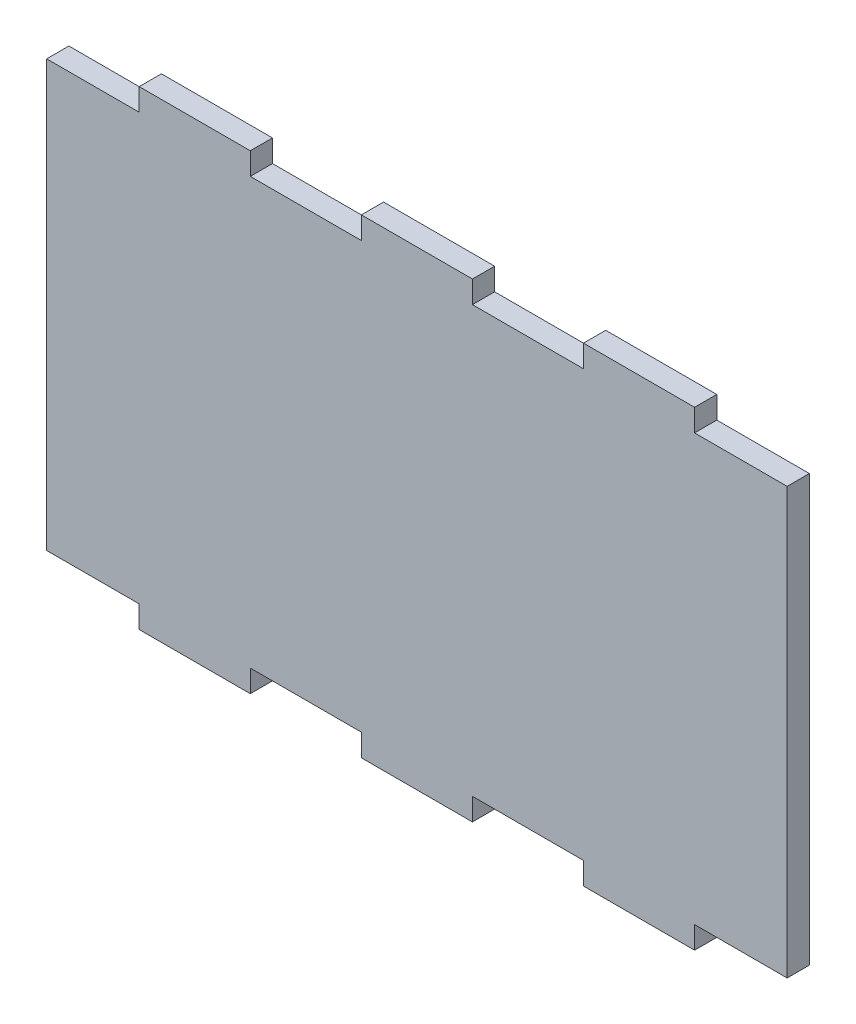
ISO-10303-21;
HEADER;
FILE_DESCRIPTION(('STEP AP214'),'2;1');
FILE_NAME('part.step','',(''),(''),'','','');
FILE_SCHEMA(('AUTOMOTIVE_DESIGN { 1 0 10303 214 1 1 1 1 }'));
ENDSEC;
DATA;
#1=APPLICATION_CONTEXT('core data for automotive mechanical design processes');
#2=APPLICATION_PROTOCOL_DEFINITION('international standard','automotive_design',2000,#1);
#3=PRODUCT_CONTEXT('',#1,'mechanical');
#4=PRODUCT('Part','Part','',(#3));
#5=PRODUCT_RELATED_PRODUCT_CATEGORY('part','',(#4));
#6=PRODUCT_DEFINITION_FORMATION('','',#4);
#7=PRODUCT_DEFINITION_CONTEXT('part definition',#1,'design');
#8=PRODUCT_DEFINITION('design','',#6,#7);
#9=PRODUCT_DEFINITION_SHAPE('','',#8);
#10=(LENGTH_UNIT() NAMED_UNIT(*) SI_UNIT(.MILLI.,.METRE.));
#11=(NAMED_UNIT(*) PLANE_ANGLE_UNIT() SI_UNIT($,.RADIAN.));
#12=(NAMED_UNIT(*) SI_UNIT($,.STERADIAN.) SOLID_ANGLE_UNIT());
#13=UNCERTAINTY_MEASURE_WITH_UNIT(LENGTH_MEASURE(1.E-05),#10,'distance_accuracy_value','');
#14=(GEOMETRIC_REPRESENTATION_CONTEXT(3) GLOBAL_UNCERTAINTY_ASSIGNED_CONTEXT((#13)) GLOBAL_UNIT_ASSIGNED_CONTEXT((#10,
#11,#12)) REPRESENTATION_CONTEXT('',''));
#15=CARTESIAN_POINT('',(0.,0.,0.));
#16=DIRECTION('',(0.,0.,1.));
#17=DIRECTION('',(1.,0.,0.));
#18=AXIS2_PLACEMENT_3D('',#15,#16,#17);
#19=CARTESIAN_POINT('',(50.,-31.75,3.));
#20=DIRECTION('',(0.,1.,0.));
#21=DIRECTION('',(-1.,0.,0.));
#22=AXIS2_PLACEMENT_3D('',#19,#20,#21);
#23=PLANE('',#22);
#24=DIRECTION('',(0.,0.,1.));
#25=VECTOR('',#24,1.);
#26=CARTESIAN_POINT('',(37.5,-31.75,0.));
#27=LINE('',#26,#25);
#28=CARTESIAN_POINT('',(37.5,-31.75,0.));
#29=VERTEX_POINT('',#28);
#30=CARTESIAN_POINT('',(37.5,-31.75,3.));
#31=VERTEX_POINT('',#30);
#32=EDGE_CURVE('E286',#29,#31,#27,.T.);
#33=ORIENTED_EDGE('',*,*,#32,.T.);
#34=DIRECTION('',(1.,0.,0.));
#35=VECTOR('',#34,1.);
#36=CARTESIAN_POINT('',(50.,-31.75,3.));
#37=LINE('',#36,#35);
#38=CARTESIAN_POINT('',(22.5,-31.75,3.));
#39=VERTEX_POINT('',#38);
#40=EDGE_CURVE('E361',#39,#31,#37,.T.);
#41=ORIENTED_EDGE('',*,*,#40,.F.);
#42=DIRECTION('',(0.,0.,1.));
#43=VECTOR('',#42,1.);
#44=CARTESIAN_POINT('',(22.5,-31.75,0.));
#45=LINE('',#44,#43);
#46=CARTESIAN_POINT('',(22.5,-31.75,0.));
#47=VERTEX_POINT('',#46);
#48=EDGE_CURVE('E310',#47,#39,#45,.T.);
#49=ORIENTED_EDGE('',*,*,#48,.F.);
#50=DIRECTION('',(1.,0.,0.));
#51=VECTOR('',#50,1.);
#52=CARTESIAN_POINT('',(50.,-31.75,0.));
#53=LINE('',#52,#51);
#54=EDGE_CURVE('E304',#47,#29,#53,.T.);
#55=ORIENTED_EDGE('',*,*,#54,.T.);
#56=EDGE_LOOP('',(#33,#41,#49,#55));
#57=FACE_BOUND('',#56,.T.);
#58=ADVANCED_FACE('F42',(#57),#23,.F.);
#59=CARTESIAN_POINT('',(0.,0.,3.));
#60=DIRECTION('',(0.,0.,1.));
#61=DIRECTION('',(1.,0.,0.));
#62=AXIS2_PLACEMENT_3D('',#59,#60,#61);
#63=PLANE('',#62);
#64=ORIENTED_EDGE('',*,*,#40,.T.);
#65=DIRECTION('',(0.,1.,0.));
#66=VECTOR('',#65,1.);
#67=CARTESIAN_POINT('',(37.5,-28.7499999999999,3.));
#68=LINE('',#67,#66);
#69=CARTESIAN_POINT('',(37.5,-28.7499999999999,3.));
#70=VERTEX_POINT('',#69);
#71=EDGE_CURVE('E292',#31,#70,#68,.T.);
#72=ORIENTED_EDGE('',*,*,#71,.T.);
#73=DIRECTION('',(1.,0.,0.));
#74=VECTOR('',#73,1.);
#75=CARTESIAN_POINT('',(37.5,-28.7499999999999,3.));
#76=LINE('',#75,#74);
#77=CARTESIAN_POINT('',(50.,-28.7499999999999,3.));
#78=VERTEX_POINT('',#77);
#79=EDGE_CURVE('E307',#70,#78,#76,.T.);
#80=ORIENTED_EDGE('',*,*,#79,.T.);
#81=DIRECTION('',(0.,1.,0.));
#82=VECTOR('',#81,1.);
#83=CARTESIAN_POINT('',(50.,-31.75,3.));
#84=LINE('',#83,#82);
#85=CARTESIAN_POINT('',(50.,28.7499999999999,3.));
#86=VERTEX_POINT('',#85);
#87=EDGE_CURVE('E378',#78,#86,#84,.T.);
#88=ORIENTED_EDGE('',*,*,#87,.T.);
#89=DIRECTION('',(1.,0.,0.));
#90=VECTOR('',#89,1.);
#91=CARTESIAN_POINT('',(37.5,28.7499999999999,3.));
#92=LINE('',#91,#90);
#93=CARTESIAN_POINT('',(37.5,28.7499999999999,3.));
#94=VERTEX_POINT('',#93);
#95=EDGE_CURVE('E467',#94,#86,#92,.T.);
#96=ORIENTED_EDGE('',*,*,#95,.F.);
#97=DIRECTION('',(0.,-1.,0.));
#98=VECTOR('',#97,1.);
#99=CARTESIAN_POINT('',(37.5,28.7499999999999,3.));
#100=LINE('',#99,#98);
#101=CARTESIAN_POINT('',(37.5,31.75,3.));
#102=VERTEX_POINT('',#101);
#103=EDGE_CURVE('E462',#102,#94,#100,.T.);
#104=ORIENTED_EDGE('',*,*,#103,.F.);
#105=DIRECTION('',(-1.,0.,0.));
#106=VECTOR('',#105,1.);
#107=CARTESIAN_POINT('',(50.,31.75,3.));
#108=LINE('',#107,#106);
#109=CARTESIAN_POINT('',(22.5,31.75,3.));
#110=VERTEX_POINT('',#109);
#111=EDGE_CURVE('E11',#102,#110,#108,.T.);
#112=ORIENTED_EDGE('',*,*,#111,.T.);
#113=DIRECTION('',(0.,1.,0.));
#114=VECTOR('',#113,1.);
#115=CARTESIAN_POINT('',(22.5,28.7499999999999,3.));
#116=LINE('',#115,#114);
#117=CARTESIAN_POINT('',(22.5,28.7499999999999,3.));
#118=VERTEX_POINT('',#117);
#119=EDGE_CURVE('E502',#118,#110,#116,.T.);
#120=ORIENTED_EDGE('',*,*,#119,.F.);
#121=DIRECTION('',(1.,0.,0.));
#122=VECTOR('',#121,1.);
#123=CARTESIAN_POINT('',(7.50000000000001,28.7499999999999,3.));
#124=LINE('',#123,#122);
#125=CARTESIAN_POINT('',(7.50000000000001,28.7499999999999,3.));
#126=VERTEX_POINT('',#125);
#127=EDGE_CURVE('E512',#126,#118,#124,.T.);
#128=ORIENTED_EDGE('',*,*,#127,.F.);
#129=DIRECTION('',(0.,-1.,0.));
#130=VECTOR('',#129,1.);
#131=CARTESIAN_POINT('',(7.50000000000001,28.7499999999999,3.));
#132=LINE('',#131,#130);
#133=CARTESIAN_POINT('',(7.5,31.75,3.));
#134=VERTEX_POINT('',#133);
#135=EDGE_CURVE('E402',#134,#126,#132,.T.);
#136=ORIENTED_EDGE('',*,*,#135,.F.);
#137=CARTESIAN_POINT('',(-7.5,31.75,3.));
#138=VERTEX_POINT('',#137);
#139=EDGE_CURVE('E52',#134,#138,#108,.T.);
#140=ORIENTED_EDGE('',*,*,#139,.T.);
#141=DIRECTION('',(0.,1.,0.));
#142=VECTOR('',#141,1.);
#143=CARTESIAN_POINT('',(-7.49999999999999,28.75,3.));
#144=LINE('',#143,#142);
#145=CARTESIAN_POINT('',(-7.49999999999999,28.75,3.));
#146=VERTEX_POINT('',#145);
#147=EDGE_CURVE('E399',#146,#138,#144,.T.);
#148=ORIENTED_EDGE('',*,*,#147,.F.);
#149=DIRECTION('',(1.,0.,0.));
#150=VECTOR('',#149,1.);
#151=CARTESIAN_POINT('',(-22.5,28.7499999999999,3.));
#152=LINE('',#151,#150);
#153=CARTESIAN_POINT('',(-22.5,28.7499999999999,3.));
#154=VERTEX_POINT('',#153);
#155=EDGE_CURVE('E416',#154,#146,#152,.T.);
#156=ORIENTED_EDGE('',*,*,#155,.F.);
#157=DIRECTION('',(0.,-1.,0.));
#158=VECTOR('',#157,1.);
#159=CARTESIAN_POINT('',(-22.5,28.7499999999999,3.));
#160=LINE('',#159,#158);
#161=CARTESIAN_POINT('',(-22.5,31.75,3.));
#162=VERTEX_POINT('',#161);
#163=EDGE_CURVE('E521',#162,#154,#160,.T.);
#164=ORIENTED_EDGE('',*,*,#163,.F.);
#165=CARTESIAN_POINT('',(-37.5,31.75,3.));
#166=VERTEX_POINT('',#165);
#167=EDGE_CURVE('E54',#162,#166,#108,.T.);
#168=ORIENTED_EDGE('',*,*,#167,.T.);
#169=DIRECTION('',(0.,1.,0.));
#170=VECTOR('',#169,1.);
#171=CARTESIAN_POINT('',(-37.5,31.75,3.));
#172=LINE('',#171,#170);
#173=CARTESIAN_POINT('',(-37.5,28.75,3.));
#174=VERTEX_POINT('',#173);
#175=EDGE_CURVE('E437',#174,#166,#172,.T.);
#176=ORIENTED_EDGE('',*,*,#175,.F.);
#177=DIRECTION('',(1.,0.,0.));
#178=VECTOR('',#177,1.);
#179=CARTESIAN_POINT('',(-50.,28.7500000000001,3.));
#180=LINE('',#179,#178);
#181=CARTESIAN_POINT('',(-50.,28.7500000000001,3.));
#182=VERTEX_POINT('',#181);
#183=EDGE_CURVE('E425',#182,#174,#180,.T.);
#184=ORIENTED_EDGE('',*,*,#183,.F.);
#185=DIRECTION('',(0.,-1.,0.));
#186=VECTOR('',#185,1.);
#187=CARTESIAN_POINT('',(-50.,-31.75,3.));
#188=LINE('',#187,#186);
#189=CARTESIAN_POINT('',(-50.,-28.75,3.));
#190=VERTEX_POINT('',#189);
#191=EDGE_CURVE('E351',#182,#190,#188,.T.);
#192=ORIENTED_EDGE('',*,*,#191,.T.);
#193=DIRECTION('',(1.,0.,0.));
#194=VECTOR('',#193,1.);
#195=CARTESIAN_POINT('',(-50.,-28.75,3.));
#196=LINE('',#195,#194);
#197=CARTESIAN_POINT('',(-37.5,-28.75,3.));
#198=VERTEX_POINT('',#197);
#199=EDGE_CURVE('E473',#190,#198,#196,.T.);
#200=ORIENTED_EDGE('',*,*,#199,.T.);
#201=DIRECTION('',(0.,-1.,0.));
#202=VECTOR('',#201,1.);
#203=CARTESIAN_POINT('',(-37.5,-31.75,3.));
#204=LINE('',#203,#202);
#205=CARTESIAN_POINT('',(-37.5,-31.75,3.));
#206=VERTEX_POINT('',#205);
#207=EDGE_CURVE('E553',#198,#206,#204,.T.);
#208=ORIENTED_EDGE('',*,*,#207,.T.);
#209=CARTESIAN_POINT('',(-22.5,-31.75,3.));
#210=VERTEX_POINT('',#209);
#211=EDGE_CURVE('E371',#206,#210,#37,.T.);
#212=ORIENTED_EDGE('',*,*,#211,.T.);
#213=DIRECTION('',(0.,1.,0.));
#214=VECTOR('',#213,1.);
#215=CARTESIAN_POINT('',(-22.5,-28.7499999999999,3.));
#216=LINE('',#215,#214);
#217=CARTESIAN_POINT('',(-22.5,-28.7499999999999,3.));
#218=VERTEX_POINT('',#217);
#219=EDGE_CURVE('E590',#210,#218,#216,.T.);
#220=ORIENTED_EDGE('',*,*,#219,.T.);
#221=DIRECTION('',(1.,0.,0.));
#222=VECTOR('',#221,1.);
#223=CARTESIAN_POINT('',(-22.5,-28.7499999999999,3.));
#224=LINE('',#223,#222);
#225=CARTESIAN_POINT('',(-7.49999999999999,-28.7499999999999,3.));
#226=VERTEX_POINT('',#225);
#227=EDGE_CURVE('E572',#218,#226,#224,.T.);
#228=ORIENTED_EDGE('',*,*,#227,.T.);
#229=DIRECTION('',(0.,-1.,0.));
#230=VECTOR('',#229,1.);
#231=CARTESIAN_POINT('',(-7.49999999999999,-28.7499999999999,3.));
#232=LINE('',#231,#230);
#233=CARTESIAN_POINT('',(-7.49999999999999,-31.75,3.));
#234=VERTEX_POINT('',#233);
#235=EDGE_CURVE('E591',#226,#234,#232,.T.);
#236=ORIENTED_EDGE('',*,*,#235,.T.);
#237=CARTESIAN_POINT('',(7.50000000000002,-31.75,3.));
#238=VERTEX_POINT('',#237);
#239=EDGE_CURVE('E369',#234,#238,#37,.T.);
#240=ORIENTED_EDGE('',*,*,#239,.T.);
#241=DIRECTION('',(0.,1.,0.));
#242=VECTOR('',#241,1.);
#243=CARTESIAN_POINT('',(7.50000000000002,-28.7499999999999,3.));
#244=LINE('',#243,#242);
#245=CARTESIAN_POINT('',(7.50000000000002,-28.7499999999999,3.));
#246=VERTEX_POINT('',#245);
#247=EDGE_CURVE('E621',#238,#246,#244,.T.);
#248=ORIENTED_EDGE('',*,*,#247,.T.);
#249=DIRECTION('',(1.,0.,0.));
#250=VECTOR('',#249,1.);
#251=CARTESIAN_POINT('',(7.50000000000002,-28.7499999999999,3.));
#252=LINE('',#251,#250);
#253=CARTESIAN_POINT('',(22.5,-28.7499999999999,3.));
#254=VERTEX_POINT('',#253);
#255=EDGE_CURVE('E613',#246,#254,#252,.T.);
#256=ORIENTED_EDGE('',*,*,#255,.T.);
#257=DIRECTION('',(0.,-1.,0.));
#258=VECTOR('',#257,1.);
#259=CARTESIAN_POINT('',(22.5,-28.7499999999999,3.));
#260=LINE('',#259,#258);
#261=EDGE_CURVE('E618',#254,#39,#260,.T.);
#262=ORIENTED_EDGE('',*,*,#261,.T.);
#263=EDGE_LOOP('',(#64,#72,#80,#88,#96,#104,#112,#120,#128,#136,#140,#148,#156,#164,#168,#176,
#184,#192,#200,#208,#212,#220,#228,#236,#240,#248,#256,#262));
#264=FACE_BOUND('',#263,.T.);
#265=ADVANCED_FACE('F397',(#264),#63,.T.);
#266=CARTESIAN_POINT('',(0.,0.,0.));
#267=DIRECTION('',(0.,0.,1.));
#268=DIRECTION('',(1.,0.,0.));
#269=AXIS2_PLACEMENT_3D('',#266,#267,#268);
#270=PLANE('',#269);
#271=DIRECTION('',(0.,1.,0.));
#272=VECTOR('',#271,1.);
#273=CARTESIAN_POINT('',(37.5,-28.7499999999999,0.));
#274=LINE('',#273,#272);
#275=CARTESIAN_POINT('',(37.5,-28.7499999999999,0.));
#276=VERTEX_POINT('',#275);
#277=EDGE_CURVE('E290',#29,#276,#274,.T.);
#278=ORIENTED_EDGE('',*,*,#277,.F.);
#279=ORIENTED_EDGE('',*,*,#54,.F.);
#280=DIRECTION('',(0.,-1.,0.));
#281=VECTOR('',#280,1.);
#282=CARTESIAN_POINT('',(22.5,-28.7499999999999,0.));
#283=LINE('',#282,#281);
#284=CARTESIAN_POINT('',(22.5,-28.7499999999999,0.));
#285=VERTEX_POINT('',#284);
#286=EDGE_CURVE('E628',#285,#47,#283,.T.);
#287=ORIENTED_EDGE('',*,*,#286,.F.);
#288=DIRECTION('',(1.,0.,0.));
#289=VECTOR('',#288,1.);
#290=CARTESIAN_POINT('',(7.50000000000002,-28.7499999999999,0.));
#291=LINE('',#290,#289);
#292=CARTESIAN_POINT('',(7.50000000000002,-28.7499999999999,0.));
#293=VERTEX_POINT('',#292);
#294=EDGE_CURVE('E607',#293,#285,#291,.T.);
#295=ORIENTED_EDGE('',*,*,#294,.F.);
#296=DIRECTION('',(0.,1.,0.));
#297=VECTOR('',#296,1.);
#298=CARTESIAN_POINT('',(7.50000000000002,-28.7499999999999,0.));
#299=LINE('',#298,#297);
#300=CARTESIAN_POINT('',(7.50000000000002,-31.75,0.));
#301=VERTEX_POINT('',#300);
#302=EDGE_CURVE('E617',#301,#293,#299,.T.);
#303=ORIENTED_EDGE('',*,*,#302,.F.);
#304=CARTESIAN_POINT('',(-7.49999999999999,-31.75,0.));
#305=VERTEX_POINT('',#304);
#306=EDGE_CURVE('E312',#305,#301,#53,.T.);
#307=ORIENTED_EDGE('',*,*,#306,.F.);
#308=DIRECTION('',(0.,-1.,0.));
#309=VECTOR('',#308,1.);
#310=CARTESIAN_POINT('',(-7.49999999999999,-28.7499999999999,0.));
#311=LINE('',#310,#309);
#312=CARTESIAN_POINT('',(-7.49999999999999,-28.7499999999999,0.));
#313=VERTEX_POINT('',#312);
#314=EDGE_CURVE('E581',#313,#305,#311,.T.);
#315=ORIENTED_EDGE('',*,*,#314,.F.);
#316=DIRECTION('',(1.,0.,0.));
#317=VECTOR('',#316,1.);
#318=CARTESIAN_POINT('',(-22.5,-28.7499999999999,0.));
#319=LINE('',#318,#317);
#320=CARTESIAN_POINT('',(-22.5,-28.7499999999999,0.));
#321=VERTEX_POINT('',#320);
#322=EDGE_CURVE('E577',#321,#313,#319,.T.);
#323=ORIENTED_EDGE('',*,*,#322,.F.);
#324=DIRECTION('',(0.,1.,0.));
#325=VECTOR('',#324,1.);
#326=CARTESIAN_POINT('',(-22.5,-28.7499999999999,0.));
#327=LINE('',#326,#325);
#328=CARTESIAN_POINT('',(-22.5,-31.75,0.));
#329=VERTEX_POINT('',#328);
#330=EDGE_CURVE('E586',#329,#321,#327,.T.);
#331=ORIENTED_EDGE('',*,*,#330,.F.);
#332=CARTESIAN_POINT('',(-37.5,-31.75,0.));
#333=VERTEX_POINT('',#332);
#334=EDGE_CURVE('E315',#333,#329,#53,.T.);
#335=ORIENTED_EDGE('',*,*,#334,.F.);
#336=DIRECTION('',(0.,-1.,0.));
#337=VECTOR('',#336,1.);
#338=CARTESIAN_POINT('',(-37.5,-31.75,0.));
#339=LINE('',#338,#337);
#340=CARTESIAN_POINT('',(-37.5,-28.75,0.));
#341=VERTEX_POINT('',#340);
#342=EDGE_CURVE('E548',#341,#333,#339,.T.);
#343=ORIENTED_EDGE('',*,*,#342,.F.);
#344=DIRECTION('',(1.,0.,0.));
#345=VECTOR('',#344,1.);
#346=CARTESIAN_POINT('',(-50.,-28.75,0.));
#347=LINE('',#346,#345);
#348=CARTESIAN_POINT('',(-50.,-28.75,0.));
#349=VERTEX_POINT('',#348);
#350=EDGE_CURVE('E478',#349,#341,#347,.T.);
#351=ORIENTED_EDGE('',*,*,#350,.F.);
#352=DIRECTION('',(0.,-1.,0.));
#353=VECTOR('',#352,1.);
#354=CARTESIAN_POINT('',(-50.,-31.75,0.));
#355=LINE('',#354,#353);
#356=CARTESIAN_POINT('',(-50.,28.7500000000001,0.));
#357=VERTEX_POINT('',#356);
#358=EDGE_CURVE('E313',#357,#349,#355,.T.);
#359=ORIENTED_EDGE('',*,*,#358,.F.);
#360=DIRECTION('',(1.,0.,0.));
#361=VECTOR('',#360,1.);
#362=CARTESIAN_POINT('',(-50.,28.7500000000001,0.));
#363=LINE('',#362,#361);
#364=CARTESIAN_POINT('',(-37.5,28.75,0.));
#365=VERTEX_POINT('',#364);
#366=EDGE_CURVE('E433',#357,#365,#363,.T.);
#367=ORIENTED_EDGE('',*,*,#366,.T.);
#368=DIRECTION('',(0.,1.,0.));
#369=VECTOR('',#368,1.);
#370=CARTESIAN_POINT('',(-37.5,31.75,0.));
#371=LINE('',#370,#369);
#372=CARTESIAN_POINT('',(-37.5,31.75,0.));
#373=VERTEX_POINT('',#372);
#374=EDGE_CURVE('E436',#365,#373,#371,.T.);
#375=ORIENTED_EDGE('',*,*,#374,.T.);
#376=DIRECTION('',(-1.,0.,0.));
#377=VECTOR('',#376,1.);
#378=CARTESIAN_POINT('',(50.,31.75,0.));
#379=LINE('',#378,#377);
#380=CARTESIAN_POINT('',(-22.5,31.75,0.));
#381=VERTEX_POINT('',#380);
#382=EDGE_CURVE('E334',#381,#373,#379,.T.);
#383=ORIENTED_EDGE('',*,*,#382,.F.);
#384=DIRECTION('',(0.,-1.,0.));
#385=VECTOR('',#384,1.);
#386=CARTESIAN_POINT('',(-22.5,28.7499999999999,0.));
#387=LINE('',#386,#385);
#388=CARTESIAN_POINT('',(-22.5,28.7499999999999,0.));
#389=VERTEX_POINT('',#388);
#390=EDGE_CURVE('E415',#381,#389,#387,.T.);
#391=ORIENTED_EDGE('',*,*,#390,.T.);
#392=DIRECTION('',(1.,0.,0.));
#393=VECTOR('',#392,1.);
#394=CARTESIAN_POINT('',(-22.5,28.7499999999999,0.));
#395=LINE('',#394,#393);
#396=CARTESIAN_POINT('',(-7.49999999999999,28.75,0.));
#397=VERTEX_POINT('',#396);
#398=EDGE_CURVE('E532',#389,#397,#395,.T.);
#399=ORIENTED_EDGE('',*,*,#398,.T.);
#400=DIRECTION('',(0.,1.,0.));
#401=VECTOR('',#400,1.);
#402=CARTESIAN_POINT('',(-7.49999999999999,28.75,0.));
#403=LINE('',#402,#401);
#404=CARTESIAN_POINT('',(-7.5,31.75,0.));
#405=VERTEX_POINT('',#404);
#406=EDGE_CURVE('E432',#397,#405,#403,.T.);
#407=ORIENTED_EDGE('',*,*,#406,.T.);
#408=CARTESIAN_POINT('',(7.5,31.75,0.));
#409=VERTEX_POINT('',#408);
#410=EDGE_CURVE('E341',#409,#405,#379,.T.);
#411=ORIENTED_EDGE('',*,*,#410,.F.);
#412=DIRECTION('',(0.,-1.,0.));
#413=VECTOR('',#412,1.);
#414=CARTESIAN_POINT('',(7.50000000000001,28.7499999999999,0.));
#415=LINE('',#414,#413);
#416=CARTESIAN_POINT('',(7.50000000000001,28.7499999999999,0.));
#417=VERTEX_POINT('',#416);
#418=EDGE_CURVE('E497',#409,#417,#415,.T.);
#419=ORIENTED_EDGE('',*,*,#418,.T.);
#420=DIRECTION('',(1.,0.,0.));
#421=VECTOR('',#420,1.);
#422=CARTESIAN_POINT('',(7.50000000000001,28.7499999999999,0.));
#423=LINE('',#422,#421);
#424=CARTESIAN_POINT('',(22.5,28.7499999999999,0.));
#425=VERTEX_POINT('',#424);
#426=EDGE_CURVE('E501',#417,#425,#423,.T.);
#427=ORIENTED_EDGE('',*,*,#426,.T.);
#428=DIRECTION('',(0.,1.,0.));
#429=VECTOR('',#428,1.);
#430=CARTESIAN_POINT('',(22.5,28.7499999999999,0.));
#431=LINE('',#430,#429);
#432=CARTESIAN_POINT('',(22.5,31.75,0.));
#433=VERTEX_POINT('',#432);
#434=EDGE_CURVE('E506',#425,#433,#431,.T.);
#435=ORIENTED_EDGE('',*,*,#434,.T.);
#436=CARTESIAN_POINT('',(37.5,31.75,0.));
#437=VERTEX_POINT('',#436);
#438=EDGE_CURVE('E46',#437,#433,#379,.T.);
#439=ORIENTED_EDGE('',*,*,#438,.F.);
#440=DIRECTION('',(0.,-1.,0.));
#441=VECTOR('',#440,1.);
#442=CARTESIAN_POINT('',(37.5,28.7499999999999,0.));
#443=LINE('',#442,#441);
#444=CARTESIAN_POINT('',(37.5,28.7499999999999,0.));
#445=VERTEX_POINT('',#444);
#446=EDGE_CURVE('E479',#437,#445,#443,.T.);
#447=ORIENTED_EDGE('',*,*,#446,.T.);
#448=DIRECTION('',(1.,0.,0.));
#449=VECTOR('',#448,1.);
#450=CARTESIAN_POINT('',(37.5,28.7499999999999,0.));
#451=LINE('',#450,#449);
#452=CARTESIAN_POINT('',(50.,28.7499999999999,0.));
#453=VERTEX_POINT('',#452);
#454=EDGE_CURVE('E483',#445,#453,#451,.T.);
#455=ORIENTED_EDGE('',*,*,#454,.T.);
#456=DIRECTION('',(0.,1.,0.));
#457=VECTOR('',#456,1.);
#458=CARTESIAN_POINT('',(50.,-31.75,0.));
#459=LINE('',#458,#457);
#460=CARTESIAN_POINT('',(50.,-28.7499999999999,0.));
#461=VERTEX_POINT('',#460);
#462=EDGE_CURVE('E326',#461,#453,#459,.T.);
#463=ORIENTED_EDGE('',*,*,#462,.F.);
#464=DIRECTION('',(1.,0.,0.));
#465=VECTOR('',#464,1.);
#466=CARTESIAN_POINT('',(37.5,-28.7499999999999,0.));
#467=LINE('',#466,#465);
#468=EDGE_CURVE('E64',#276,#461,#467,.T.);
#469=ORIENTED_EDGE('',*,*,#468,.F.);
#470=EDGE_LOOP('',(#278,#279,#287,#295,#303,#307,#315,#323,#331,#335,#343,#351,#359,#367,#375,
#383,#391,#399,#407,#411,#419,#427,#435,#439,#447,#455,#463,#469));
#471=FACE_BOUND('',#470,.T.);
#472=ADVANCED_FACE('F302',(#471),#270,.F.);
#473=CARTESIAN_POINT('',(50.,-31.75,3.));
#474=DIRECTION('',(-1.,0.,0.));
#475=DIRECTION('',(0.,0.,1.));
#476=AXIS2_PLACEMENT_3D('',#473,#474,#475);
#477=PLANE('',#476);
#478=DIRECTION('',(0.,0.,1.));
#479=VECTOR('',#478,1.);
#480=CARTESIAN_POINT('',(50.,-28.7499999999999,0.));
#481=LINE('',#480,#479);
#482=EDGE_CURVE('E298',#461,#78,#481,.T.);
#483=ORIENTED_EDGE('',*,*,#482,.F.);
#484=ORIENTED_EDGE('',*,*,#462,.T.);
#485=DIRECTION('',(0.,0.,1.));
#486=VECTOR('',#485,1.);
#487=CARTESIAN_POINT('',(50.,28.7499999999999,0.));
#488=LINE('',#487,#486);
#489=EDGE_CURVE('E493',#453,#86,#488,.T.);
#490=ORIENTED_EDGE('',*,*,#489,.T.);
#491=ORIENTED_EDGE('',*,*,#87,.F.);
#492=EDGE_LOOP('',(#483,#484,#490,#491));
#493=FACE_BOUND('',#492,.T.);
#494=ADVANCED_FACE('F675',(#493),#477,.F.);
#495=DIRECTION('',(0.,0.,1.));
#496=VECTOR('',#495,1.);
#497=CARTESIAN_POINT('',(7.50000000000002,-31.75,0.));
#498=LINE('',#497,#496);
#499=EDGE_CURVE('E603',#301,#238,#498,.T.);
#500=ORIENTED_EDGE('',*,*,#499,.T.);
#501=ORIENTED_EDGE('',*,*,#239,.F.);
#502=DIRECTION('',(0.,0.,1.));
#503=VECTOR('',#502,1.);
#504=CARTESIAN_POINT('',(-7.49999999999999,-31.75,0.));
#505=LINE('',#504,#503);
#506=EDGE_CURVE('E569',#305,#234,#505,.T.);
#507=ORIENTED_EDGE('',*,*,#506,.F.);
#508=ORIENTED_EDGE('',*,*,#306,.T.);
#509=EDGE_LOOP('',(#500,#501,#507,#508));
#510=FACE_BOUND('',#509,.T.);
#511=ADVANCED_FACE('F652',(#510),#23,.F.);
#512=DIRECTION('',(0.,0.,1.));
#513=VECTOR('',#512,1.);
#514=CARTESIAN_POINT('',(-22.5,-31.75,0.));
#515=LINE('',#514,#513);
#516=EDGE_CURVE('E576',#329,#210,#515,.T.);
#517=ORIENTED_EDGE('',*,*,#516,.T.);
#518=ORIENTED_EDGE('',*,*,#211,.F.);
#519=DIRECTION('',(0.,0.,1.));
#520=VECTOR('',#519,1.);
#521=CARTESIAN_POINT('',(-37.5,-31.75,0.));
#522=LINE('',#521,#520);
#523=EDGE_CURVE('E470',#333,#206,#522,.T.);
#524=ORIENTED_EDGE('',*,*,#523,.F.);
#525=ORIENTED_EDGE('',*,*,#334,.T.);
#526=EDGE_LOOP('',(#517,#518,#524,#525));
#527=FACE_BOUND('',#526,.T.);
#528=ADVANCED_FACE('F668',(#527),#23,.F.);
#529=CARTESIAN_POINT('',(-50.,-31.75,3.));
#530=DIRECTION('',(1.,0.,0.));
#531=DIRECTION('',(0.,0.,-1.));
#532=AXIS2_PLACEMENT_3D('',#529,#530,#531);
#533=PLANE('',#532);
#534=DIRECTION('',(0.,0.,1.));
#535=VECTOR('',#534,1.);
#536=CARTESIAN_POINT('',(-50.,-28.75,0.));
#537=LINE('',#536,#535);
#538=EDGE_CURVE('E457',#349,#190,#537,.T.);
#539=ORIENTED_EDGE('',*,*,#538,.T.);
#540=ORIENTED_EDGE('',*,*,#191,.F.);
#541=DIRECTION('',(0.,0.,1.));
#542=VECTOR('',#541,1.);
#543=CARTESIAN_POINT('',(-50.,28.7500000000001,0.));
#544=LINE('',#543,#542);
#545=EDGE_CURVE('E373',#357,#182,#544,.T.);
#546=ORIENTED_EDGE('',*,*,#545,.F.);
#547=ORIENTED_EDGE('',*,*,#358,.T.);
#548=EDGE_LOOP('',(#539,#540,#546,#547));
#549=FACE_BOUND('',#548,.T.);
#550=ADVANCED_FACE('F44',(#549),#533,.F.);
#551=CARTESIAN_POINT('',(50.,31.75,3.));
#552=DIRECTION('',(0.,-1.,0.));
#553=DIRECTION('',(1.,0.,0.));
#554=AXIS2_PLACEMENT_3D('',#551,#552,#553);
#555=PLANE('',#554);
#556=ORIENTED_EDGE('',*,*,#139,.F.);
#557=DIRECTION('',(0.,0.,1.));
#558=VECTOR('',#557,1.);
#559=CARTESIAN_POINT('',(7.5,31.75,0.));
#560=LINE('',#559,#558);
#561=EDGE_CURVE('E519',#409,#134,#560,.T.);
#562=ORIENTED_EDGE('',*,*,#561,.F.);
#563=ORIENTED_EDGE('',*,*,#410,.T.);
#564=DIRECTION('',(0.,0.,1.));
#565=VECTOR('',#564,1.);
#566=CARTESIAN_POINT('',(-7.5,31.75,0.));
#567=LINE('',#566,#565);
#568=EDGE_CURVE('E409',#405,#138,#567,.T.);
#569=ORIENTED_EDGE('',*,*,#568,.T.);
#570=EDGE_LOOP('',(#556,#562,#563,#569));
#571=FACE_BOUND('',#570,.T.);
#572=ADVANCED_FACE('F418',(#571),#555,.F.);
#573=ORIENTED_EDGE('',*,*,#167,.F.);
#574=DIRECTION('',(0.,0.,1.));
#575=VECTOR('',#574,1.);
#576=CARTESIAN_POINT('',(-22.5,31.75,0.));
#577=LINE('',#576,#575);
#578=EDGE_CURVE('E421',#381,#162,#577,.T.);
#579=ORIENTED_EDGE('',*,*,#578,.F.);
#580=ORIENTED_EDGE('',*,*,#382,.T.);
#581=DIRECTION('',(0.,0.,1.));
#582=VECTOR('',#581,1.);
#583=CARTESIAN_POINT('',(-37.5,31.75,0.));
#584=LINE('',#583,#582);
#585=EDGE_CURVE('E322',#373,#166,#584,.T.);
#586=ORIENTED_EDGE('',*,*,#585,.T.);
#587=EDGE_LOOP('',(#573,#579,#580,#586));
#588=FACE_BOUND('',#587,.T.);
#589=ADVANCED_FACE('F545',(#588),#555,.F.);
#590=ORIENTED_EDGE('',*,*,#111,.F.);
#591=DIRECTION('',(0.,0.,1.));
#592=VECTOR('',#591,1.);
#593=CARTESIAN_POINT('',(37.5,31.75,0.));
#594=LINE('',#593,#592);
#595=EDGE_CURVE('E490',#437,#102,#594,.T.);
#596=ORIENTED_EDGE('',*,*,#595,.F.);
#597=ORIENTED_EDGE('',*,*,#438,.T.);
#598=DIRECTION('',(0.,0.,1.));
#599=VECTOR('',#598,1.);
#600=CARTESIAN_POINT('',(22.5,31.75,0.));
#601=LINE('',#600,#599);
#602=EDGE_CURVE('E522',#433,#110,#601,.T.);
#603=ORIENTED_EDGE('',*,*,#602,.T.);
#604=EDGE_LOOP('',(#590,#596,#597,#603));
#605=FACE_BOUND('',#604,.T.);
#606=ADVANCED_FACE('F684',(#605),#555,.F.);
#607=CARTESIAN_POINT('',(-37.5,31.75,0.));
#608=DIRECTION('',(1.,0.,0.));
#609=DIRECTION('',(0.,0.,-1.));
#610=AXIS2_PLACEMENT_3D('',#607,#608,#609);
#611=PLANE('',#610);
#612=ORIENTED_EDGE('',*,*,#175,.T.);
#613=ORIENTED_EDGE('',*,*,#585,.F.);
#614=ORIENTED_EDGE('',*,*,#374,.F.);
#615=DIRECTION('',(0.,0.,1.));
#616=VECTOR('',#615,1.);
#617=CARTESIAN_POINT('',(-37.5,28.75,0.));
#618=LINE('',#617,#616);
#619=EDGE_CURVE('E445',#365,#174,#618,.T.);
#620=ORIENTED_EDGE('',*,*,#619,.T.);
#621=EDGE_LOOP('',(#612,#613,#614,#620));
#622=FACE_BOUND('',#621,.T.);
#623=ADVANCED_FACE('F546',(#622),#611,.F.);
#624=CARTESIAN_POINT('',(-50.,28.7500000000001,0.));
#625=DIRECTION('',(0.,-1.,0.));
#626=DIRECTION('',(0.,0.,-1.));
#627=AXIS2_PLACEMENT_3D('',#624,#625,#626);
#628=PLANE('',#627);
#629=ORIENTED_EDGE('',*,*,#183,.T.);
#630=ORIENTED_EDGE('',*,*,#619,.F.);
#631=ORIENTED_EDGE('',*,*,#366,.F.);
#632=ORIENTED_EDGE('',*,*,#545,.T.);
#633=EDGE_LOOP('',(#629,#630,#631,#632));
#634=FACE_BOUND('',#633,.T.);
#635=ADVANCED_FACE('F453',(#634),#628,.F.);
#636=CARTESIAN_POINT('',(-22.5,28.7499999999999,0.));
#637=DIRECTION('',(-1.,0.,0.));
#638=DIRECTION('',(0.,0.,1.));
#639=AXIS2_PLACEMENT_3D('',#636,#637,#638);
#640=PLANE('',#639);
#641=ORIENTED_EDGE('',*,*,#163,.T.);
#642=DIRECTION('',(0.,0.,1.));
#643=VECTOR('',#642,1.);
#644=CARTESIAN_POINT('',(-22.5,28.7499999999999,0.));
#645=LINE('',#644,#643);
#646=EDGE_CURVE('E428',#389,#154,#645,.T.);
#647=ORIENTED_EDGE('',*,*,#646,.F.);
#648=ORIENTED_EDGE('',*,*,#390,.F.);
#649=ORIENTED_EDGE('',*,*,#578,.T.);
#650=EDGE_LOOP('',(#641,#647,#648,#649));
#651=FACE_BOUND('',#650,.T.);
#652=ADVANCED_FACE('F705',(#651),#640,.F.);
#653=CARTESIAN_POINT('',(-7.49999999999999,28.75,0.));
#654=DIRECTION('',(1.,0.,0.));
#655=DIRECTION('',(0.,0.,-1.));
#656=AXIS2_PLACEMENT_3D('',#653,#654,#655);
#657=PLANE('',#656);
#658=ORIENTED_EDGE('',*,*,#147,.T.);
#659=ORIENTED_EDGE('',*,*,#568,.F.);
#660=ORIENTED_EDGE('',*,*,#406,.F.);
#661=DIRECTION('',(0.,0.,1.));
#662=VECTOR('',#661,1.);
#663=CARTESIAN_POINT('',(-7.49999999999999,28.75,0.));
#664=LINE('',#663,#662);
#665=EDGE_CURVE('E412',#397,#146,#664,.T.);
#666=ORIENTED_EDGE('',*,*,#665,.T.);
#667=EDGE_LOOP('',(#658,#659,#660,#666));
#668=FACE_BOUND('',#667,.T.);
#669=ADVANCED_FACE('F408',(#668),#657,.F.);
#670=CARTESIAN_POINT('',(-22.5,28.7499999999999,0.));
#671=DIRECTION('',(0.,-1.,0.));
#672=DIRECTION('',(0.,0.,-1.));
#673=AXIS2_PLACEMENT_3D('',#670,#671,#672);
#674=PLANE('',#673);
#675=ORIENTED_EDGE('',*,*,#155,.T.);
#676=ORIENTED_EDGE('',*,*,#665,.F.);
#677=ORIENTED_EDGE('',*,*,#398,.F.);
#678=ORIENTED_EDGE('',*,*,#646,.T.);
#679=EDGE_LOOP('',(#675,#676,#677,#678));
#680=FACE_BOUND('',#679,.T.);
#681=ADVANCED_FACE('F542',(#680),#674,.F.);
#682=CARTESIAN_POINT('',(7.50000000000001,28.7499999999999,0.));
#683=DIRECTION('',(-1.,0.,0.));
#684=DIRECTION('',(0.,0.,1.));
#685=AXIS2_PLACEMENT_3D('',#682,#683,#684);
#686=PLANE('',#685);
#687=ORIENTED_EDGE('',*,*,#135,.T.);
#688=DIRECTION('',(0.,0.,1.));
#689=VECTOR('',#688,1.);
#690=CARTESIAN_POINT('',(7.50000000000001,28.7499999999999,0.));
#691=LINE('',#690,#689);
#692=EDGE_CURVE('E510',#417,#126,#691,.T.);
#693=ORIENTED_EDGE('',*,*,#692,.F.);
#694=ORIENTED_EDGE('',*,*,#418,.F.);
#695=ORIENTED_EDGE('',*,*,#561,.T.);
#696=EDGE_LOOP('',(#687,#693,#694,#695));
#697=FACE_BOUND('',#696,.T.);
#698=ADVANCED_FACE('F704',(#697),#686,.F.);
#699=CARTESIAN_POINT('',(22.5,28.7499999999999,0.));
#700=DIRECTION('',(1.,0.,0.));
#701=DIRECTION('',(0.,0.,-1.));
#702=AXIS2_PLACEMENT_3D('',#699,#700,#701);
#703=PLANE('',#702);
#704=ORIENTED_EDGE('',*,*,#119,.T.);
#705=ORIENTED_EDGE('',*,*,#602,.F.);
#706=ORIENTED_EDGE('',*,*,#434,.F.);
#707=DIRECTION('',(0.,0.,1.));
#708=VECTOR('',#707,1.);
#709=CARTESIAN_POINT('',(22.5,28.7499999999999,0.));
#710=LINE('',#709,#708);
#711=EDGE_CURVE('E524',#425,#118,#710,.T.);
#712=ORIENTED_EDGE('',*,*,#711,.T.);
#713=EDGE_LOOP('',(#704,#705,#706,#712));
#714=FACE_BOUND('',#713,.T.);
#715=ADVANCED_FACE('F698',(#714),#703,.F.);
#716=CARTESIAN_POINT('',(7.50000000000001,28.7499999999999,0.));
#717=DIRECTION('',(0.,-1.,0.));
#718=DIRECTION('',(0.,0.,-1.));
#719=AXIS2_PLACEMENT_3D('',#716,#717,#718);
#720=PLANE('',#719);
#721=ORIENTED_EDGE('',*,*,#127,.T.);
#722=ORIENTED_EDGE('',*,*,#711,.F.);
#723=ORIENTED_EDGE('',*,*,#426,.F.);
#724=ORIENTED_EDGE('',*,*,#692,.T.);
#725=EDGE_LOOP('',(#721,#722,#723,#724));
#726=FACE_BOUND('',#725,.T.);
#727=ADVANCED_FACE('F702',(#726),#720,.F.);
#728=CARTESIAN_POINT('',(37.5,28.7499999999999,0.));
#729=DIRECTION('',(-1.,0.,0.));
#730=DIRECTION('',(0.,0.,1.));
#731=AXIS2_PLACEMENT_3D('',#728,#729,#730);
#732=PLANE('',#731);
#733=ORIENTED_EDGE('',*,*,#103,.T.);
#734=DIRECTION('',(0.,0.,1.));
#735=VECTOR('',#734,1.);
#736=CARTESIAN_POINT('',(37.5,28.7499999999999,0.));
#737=LINE('',#736,#735);
#738=EDGE_CURVE('E486',#445,#94,#737,.T.);
#739=ORIENTED_EDGE('',*,*,#738,.F.);
#740=ORIENTED_EDGE('',*,*,#446,.F.);
#741=ORIENTED_EDGE('',*,*,#595,.T.);
#742=EDGE_LOOP('',(#733,#739,#740,#741));
#743=FACE_BOUND('',#742,.T.);
#744=ADVANCED_FACE('F725',(#743),#732,.F.);
#745=CARTESIAN_POINT('',(37.5,28.7499999999999,0.));
#746=DIRECTION('',(0.,-1.,0.));
#747=DIRECTION('',(0.,0.,-1.));
#748=AXIS2_PLACEMENT_3D('',#745,#746,#747);
#749=PLANE('',#748);
#750=ORIENTED_EDGE('',*,*,#95,.T.);
#751=ORIENTED_EDGE('',*,*,#489,.F.);
#752=ORIENTED_EDGE('',*,*,#454,.F.);
#753=ORIENTED_EDGE('',*,*,#738,.T.);
#754=EDGE_LOOP('',(#750,#751,#752,#753));
#755=FACE_BOUND('',#754,.T.);
#756=ADVANCED_FACE('F723',(#755),#749,.F.);
#757=CARTESIAN_POINT('',(-50.,-28.75,0.));
#758=DIRECTION('',(0.,-1.,0.));
#759=DIRECTION('',(0.,0.,-1.));
#760=AXIS2_PLACEMENT_3D('',#757,#758,#759);
#761=PLANE('',#760);
#762=ORIENTED_EDGE('',*,*,#199,.F.);
#763=ORIENTED_EDGE('',*,*,#538,.F.);
#764=ORIENTED_EDGE('',*,*,#350,.T.);
#765=DIRECTION('',(0.,0.,1.));
#766=VECTOR('',#765,1.);
#767=CARTESIAN_POINT('',(-37.5,-28.75,0.));
#768=LINE('',#767,#766);
#769=EDGE_CURVE('E463',#341,#198,#768,.T.);
#770=ORIENTED_EDGE('',*,*,#769,.T.);
#771=EDGE_LOOP('',(#762,#763,#764,#770));
#772=FACE_BOUND('',#771,.T.);
#773=ADVANCED_FACE('F732',(#772),#761,.T.);
#774=CARTESIAN_POINT('',(-37.5,-31.75,0.));
#775=DIRECTION('',(-1.,0.,0.));
#776=DIRECTION('',(0.,0.,1.));
#777=AXIS2_PLACEMENT_3D('',#774,#775,#776);
#778=PLANE('',#777);
#779=ORIENTED_EDGE('',*,*,#207,.F.);
#780=ORIENTED_EDGE('',*,*,#769,.F.);
#781=ORIENTED_EDGE('',*,*,#342,.T.);
#782=ORIENTED_EDGE('',*,*,#523,.T.);
#783=EDGE_LOOP('',(#779,#780,#781,#782));
#784=FACE_BOUND('',#783,.T.);
#785=ADVANCED_FACE('F664',(#784),#778,.T.);
#786=CARTESIAN_POINT('',(-22.5,-28.7499999999999,0.));
#787=DIRECTION('',(1.,0.,0.));
#788=DIRECTION('',(0.,0.,-1.));
#789=AXIS2_PLACEMENT_3D('',#786,#787,#788);
#790=PLANE('',#789);
#791=ORIENTED_EDGE('',*,*,#219,.F.);
#792=ORIENTED_EDGE('',*,*,#516,.F.);
#793=ORIENTED_EDGE('',*,*,#330,.T.);
#794=DIRECTION('',(0.,0.,1.));
#795=VECTOR('',#794,1.);
#796=CARTESIAN_POINT('',(-22.5,-28.7499999999999,0.));
#797=LINE('',#796,#795);
#798=EDGE_CURVE('E556',#321,#218,#797,.T.);
#799=ORIENTED_EDGE('',*,*,#798,.T.);
#800=EDGE_LOOP('',(#791,#792,#793,#799));
#801=FACE_BOUND('',#800,.T.);
#802=ADVANCED_FACE('F657',(#801),#790,.T.);
#803=CARTESIAN_POINT('',(-22.5,-28.7499999999999,0.));
#804=DIRECTION('',(0.,-1.,0.));
#805=DIRECTION('',(0.,0.,-1.));
#806=AXIS2_PLACEMENT_3D('',#803,#804,#805);
#807=PLANE('',#806);
#808=ORIENTED_EDGE('',*,*,#227,.F.);
#809=ORIENTED_EDGE('',*,*,#798,.F.);
#810=ORIENTED_EDGE('',*,*,#322,.T.);
#811=DIRECTION('',(0.,0.,1.));
#812=VECTOR('',#811,1.);
#813=CARTESIAN_POINT('',(-7.49999999999999,-28.7499999999999,0.));
#814=LINE('',#813,#812);
#815=EDGE_CURVE('E562',#313,#226,#814,.T.);
#816=ORIENTED_EDGE('',*,*,#815,.T.);
#817=EDGE_LOOP('',(#808,#809,#810,#816));
#818=FACE_BOUND('',#817,.T.);
#819=ADVANCED_FACE('F655',(#818),#807,.T.);
#820=CARTESIAN_POINT('',(-7.49999999999999,-28.7499999999999,0.));
#821=DIRECTION('',(-1.,0.,0.));
#822=DIRECTION('',(0.,0.,1.));
#823=AXIS2_PLACEMENT_3D('',#820,#821,#822);
#824=PLANE('',#823);
#825=ORIENTED_EDGE('',*,*,#235,.F.);
#826=ORIENTED_EDGE('',*,*,#815,.F.);
#827=ORIENTED_EDGE('',*,*,#314,.T.);
#828=ORIENTED_EDGE('',*,*,#506,.T.);
#829=EDGE_LOOP('',(#825,#826,#827,#828));
#830=FACE_BOUND('',#829,.T.);
#831=ADVANCED_FACE('F654',(#830),#824,.T.);
#832=CARTESIAN_POINT('',(7.50000000000002,-28.7499999999999,0.));
#833=DIRECTION('',(1.,0.,0.));
#834=DIRECTION('',(0.,0.,-1.));
#835=AXIS2_PLACEMENT_3D('',#832,#833,#834);
#836=PLANE('',#835);
#837=ORIENTED_EDGE('',*,*,#247,.F.);
#838=ORIENTED_EDGE('',*,*,#499,.F.);
#839=ORIENTED_EDGE('',*,*,#302,.T.);
#840=DIRECTION('',(0.,0.,1.));
#841=VECTOR('',#840,1.);
#842=CARTESIAN_POINT('',(7.50000000000002,-28.7499999999999,0.));
#843=LINE('',#842,#841);
#844=EDGE_CURVE('E592',#293,#246,#843,.T.);
#845=ORIENTED_EDGE('',*,*,#844,.T.);
#846=EDGE_LOOP('',(#837,#838,#839,#845));
#847=FACE_BOUND('',#846,.T.);
#848=ADVANCED_FACE('F648',(#847),#836,.T.);
#849=CARTESIAN_POINT('',(7.50000000000002,-28.7499999999999,0.));
#850=DIRECTION('',(0.,-1.,0.));
#851=DIRECTION('',(0.,0.,-1.));
#852=AXIS2_PLACEMENT_3D('',#849,#850,#851);
#853=PLANE('',#852);
#854=ORIENTED_EDGE('',*,*,#255,.F.);
#855=ORIENTED_EDGE('',*,*,#844,.F.);
#856=ORIENTED_EDGE('',*,*,#294,.T.);
#857=DIRECTION('',(0.,0.,1.));
#858=VECTOR('',#857,1.);
#859=CARTESIAN_POINT('',(22.5,-28.7499999999999,0.));
#860=LINE('',#859,#858);
#861=EDGE_CURVE('E75',#285,#254,#860,.T.);
#862=ORIENTED_EDGE('',*,*,#861,.T.);
#863=EDGE_LOOP('',(#854,#855,#856,#862));
#864=FACE_BOUND('',#863,.T.);
#865=ADVANCED_FACE('F646',(#864),#853,.T.);
#866=CARTESIAN_POINT('',(22.5,-28.7499999999999,0.));
#867=DIRECTION('',(-1.,0.,0.));
#868=DIRECTION('',(0.,0.,1.));
#869=AXIS2_PLACEMENT_3D('',#866,#867,#868);
#870=PLANE('',#869);
#871=ORIENTED_EDGE('',*,*,#261,.F.);
#872=ORIENTED_EDGE('',*,*,#861,.F.);
#873=ORIENTED_EDGE('',*,*,#286,.T.);
#874=ORIENTED_EDGE('',*,*,#48,.T.);
#875=EDGE_LOOP('',(#871,#872,#873,#874));
#876=FACE_BOUND('',#875,.T.);
#877=ADVANCED_FACE('F640',(#876),#870,.T.);
#878=CARTESIAN_POINT('',(37.5,-28.7499999999999,0.));
#879=DIRECTION('',(1.,0.,0.));
#880=DIRECTION('',(0.,0.,-1.));
#881=AXIS2_PLACEMENT_3D('',#878,#879,#880);
#882=PLANE('',#881);
#883=ORIENTED_EDGE('',*,*,#71,.F.);
#884=ORIENTED_EDGE('',*,*,#32,.F.);
#885=ORIENTED_EDGE('',*,*,#277,.T.);
#886=DIRECTION('',(0.,0.,1.));
#887=VECTOR('',#886,1.);
#888=CARTESIAN_POINT('',(37.5,-28.7499999999999,0.));
#889=LINE('',#888,#887);
#890=EDGE_CURVE('E625',#276,#70,#889,.T.);
#891=ORIENTED_EDGE('',*,*,#890,.T.);
#892=EDGE_LOOP('',(#883,#884,#885,#891));
#893=FACE_BOUND('',#892,.T.);
#894=ADVANCED_FACE('F288',(#893),#882,.T.);
#895=CARTESIAN_POINT('',(37.5,-28.7499999999999,0.));
#896=DIRECTION('',(0.,-1.,0.));
#897=DIRECTION('',(0.,0.,-1.));
#898=AXIS2_PLACEMENT_3D('',#895,#896,#897);
#899=PLANE('',#898);
#900=ORIENTED_EDGE('',*,*,#79,.F.);
#901=ORIENTED_EDGE('',*,*,#890,.F.);
#902=ORIENTED_EDGE('',*,*,#468,.T.);
#903=ORIENTED_EDGE('',*,*,#482,.T.);
#904=EDGE_LOOP('',(#900,#901,#902,#903));
#905=FACE_BOUND('',#904,.T.);
#906=ADVANCED_FACE('F844',(#905),#899,.T.);
#907=CLOSED_SHELL('',(#58,#265,#472,#494,#511,#528,#550,#572,#589,#606,#623,#635,#652,#669,#681,
#698,#715,#727,#744,#756,#773,#785,#802,#819,#831,#848,#865,#877,#894,#906));
#908=MANIFOLD_SOLID_BREP('B2',#907);
#909=ADVANCED_BREP_SHAPE_REPRESENTATION('',(#18,#908),#14);
#910=SHAPE_DEFINITION_REPRESENTATION(#9,#909);
ENDSEC;
END-ISO-10303-21;
